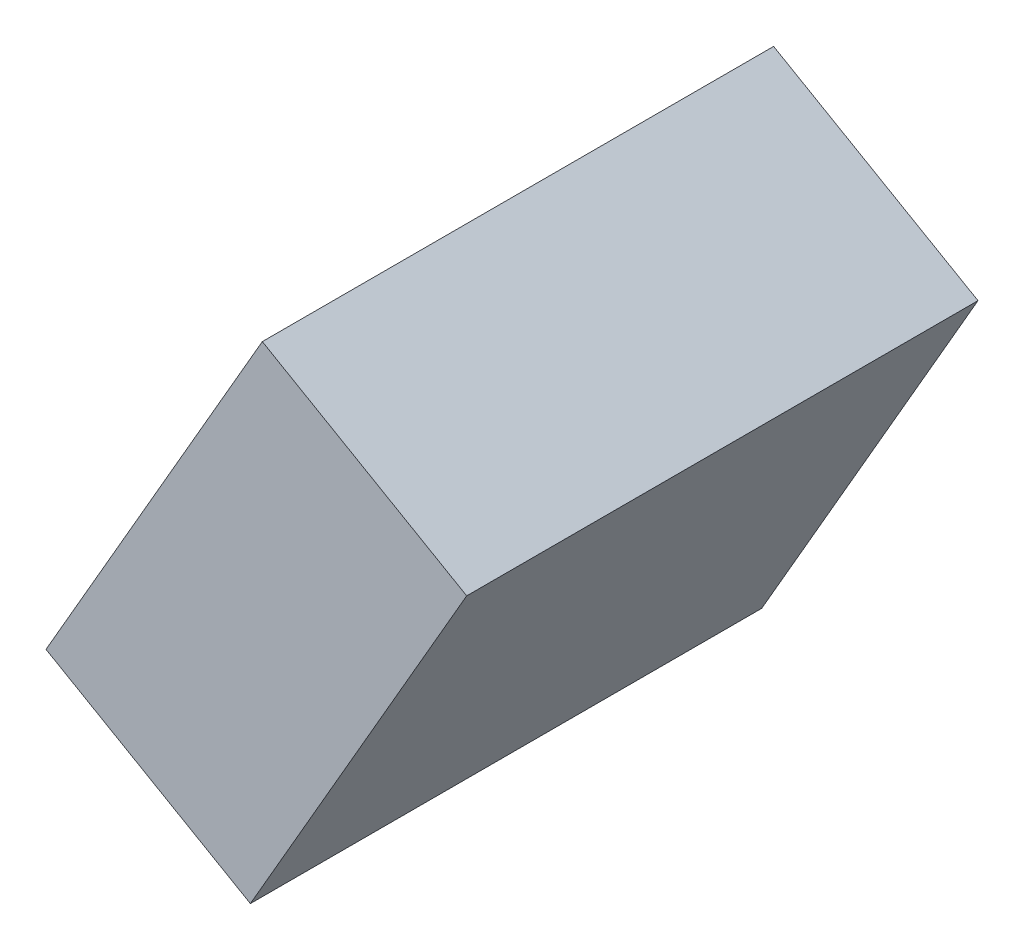
ISO-10303-21;
HEADER;
FILE_DESCRIPTION(('STEP AP214'),'2;1');
FILE_NAME('part.step','',(''),(''),'','','');
FILE_SCHEMA(('AUTOMOTIVE_DESIGN { 1 0 10303 214 1 1 1 1 }'));
ENDSEC;
DATA;
#1=APPLICATION_CONTEXT('core data for automotive mechanical design processes');
#2=APPLICATION_PROTOCOL_DEFINITION('international standard','automotive_design',2000,#1);
#3=PRODUCT_CONTEXT('',#1,'mechanical');
#4=PRODUCT('Part','Part','',(#3));
#5=PRODUCT_RELATED_PRODUCT_CATEGORY('part','',(#4));
#6=PRODUCT_DEFINITION_FORMATION('','',#4);
#7=PRODUCT_DEFINITION_CONTEXT('part definition',#1,'design');
#8=PRODUCT_DEFINITION('design','',#6,#7);
#9=PRODUCT_DEFINITION_SHAPE('','',#8);
#10=(LENGTH_UNIT() NAMED_UNIT(*) SI_UNIT(.MILLI.,.METRE.));
#11=(NAMED_UNIT(*) PLANE_ANGLE_UNIT() SI_UNIT($,.RADIAN.));
#12=(NAMED_UNIT(*) SI_UNIT($,.STERADIAN.) SOLID_ANGLE_UNIT());
#13=UNCERTAINTY_MEASURE_WITH_UNIT(LENGTH_MEASURE(1.E-05),#10,'distance_accuracy_value','');
#14=(GEOMETRIC_REPRESENTATION_CONTEXT(3) GLOBAL_UNCERTAINTY_ASSIGNED_CONTEXT((#13)) GLOBAL_UNIT_ASSIGNED_CONTEXT((#10,
#11,#12)) REPRESENTATION_CONTEXT('',''));
#15=CARTESIAN_POINT('',(0.,0.,0.));
#16=DIRECTION('',(0.,0.,1.));
#17=DIRECTION('',(1.,0.,0.));
#18=AXIS2_PLACEMENT_3D('',#15,#16,#17);
#19=CARTESIAN_POINT('',(-0.01519174000001,-0.62631066,0.));
#20=DIRECTION('',(-0.866024467662735,0.500001621406847,0.));
#21=DIRECTION('',(-0.500001621406847,-0.866024467662735,0.));
#22=AXIS2_PLACEMENT_3D('',#19,#20,#21);
#23=PLANE('',#22);
#24=DIRECTION('',(0.,0.,1.));
#25=VECTOR('',#24,1.);
#26=CARTESIAN_POINT('',(0.53480716,0.32631126,0.));
#27=LINE('',#26,#25);
#28=CARTESIAN_POINT('',(0.534807160000023,0.326311259999987,0.));
#29=VERTEX_POINT('',#28);
#30=CARTESIAN_POINT('',(0.534807160000023,0.326311259999987,1.29999994));
#31=VERTEX_POINT('',#30);
#32=EDGE_CURVE('E20',#29,#31,#27,.T.);
#33=ORIENTED_EDGE('',*,*,#32,.T.);
#34=DIRECTION('',(-0.500001621406764,-0.866024467662783,0.));
#35=VECTOR('',#34,1.);
#36=CARTESIAN_POINT('',(0.53480716,0.32631126,1.29999994));
#37=LINE('',#36,#35);
#38=CARTESIAN_POINT('',(-0.0151917399999705,-0.626310659999932,1.29999994));
#39=VERTEX_POINT('',#38);
#40=EDGE_CURVE('E55',#31,#39,#37,.T.);
#41=ORIENTED_EDGE('',*,*,#40,.T.);
#42=DIRECTION('',(0.,0.,1.));
#43=VECTOR('',#42,1.);
#44=CARTESIAN_POINT('',(-0.0151917399998524,-0.626310659999727,0.));
#45=LINE('',#44,#43);
#46=CARTESIAN_POINT('',(-0.0151917399999705,-0.626310659999932,0.));
#47=VERTEX_POINT('',#46);
#48=EDGE_CURVE('E76',#39,#47,#45,.F.);
#49=ORIENTED_EDGE('',*,*,#48,.T.);
#50=DIRECTION('',(-0.500001621406764,-0.866024467662783,0.));
#51=VECTOR('',#50,1.);
#52=CARTESIAN_POINT('',(0.53480716,0.32631126,0.));
#53=LINE('',#52,#51);
#54=EDGE_CURVE('E58',#29,#47,#53,.T.);
#55=ORIENTED_EDGE('',*,*,#54,.F.);
#56=EDGE_LOOP('',(#33,#41,#49,#55));
#57=FACE_BOUND('',#56,.T.);
#58=ADVANCED_FACE('F17',(#57),#23,.F.);
#59=CARTESIAN_POINT('',(0.53480716,0.32631126,0.));
#60=DIRECTION('',(-0.500002296729118,-0.866024077763204,0.));
#61=DIRECTION('',(0.866024077763204,-0.500002296729118,0.));
#62=AXIS2_PLACEMENT_3D('',#59,#60,#61);
#63=PLANE('',#62);
#64=DIRECTION('',(0.,0.,1.));
#65=VECTOR('',#64,1.);
#66=CARTESIAN_POINT('',(0.01519173999998,0.6263132,0.));
#67=LINE('',#66,#65);
#68=CARTESIAN_POINT('',(0.0151917400000308,0.626313200000088,0.));
#69=VERTEX_POINT('',#68);
#70=CARTESIAN_POINT('',(0.0151917400000308,0.626313200000088,1.29999994));
#71=VERTEX_POINT('',#70);
#72=EDGE_CURVE('E73',#69,#71,#67,.T.);
#73=ORIENTED_EDGE('',*,*,#72,.T.);
#74=DIRECTION('',(0.866024077763373,-0.500002296728824,0.));
#75=VECTOR('',#74,1.);
#76=CARTESIAN_POINT('',(0.01519173999998,0.6263132,1.29999994));
#77=LINE('',#76,#75);
#78=EDGE_CURVE('E63',#71,#31,#77,.T.);
#79=ORIENTED_EDGE('',*,*,#78,.T.);
#80=ORIENTED_EDGE('',*,*,#32,.F.);
#81=DIRECTION('',(0.866024077763373,-0.500002296728824,0.));
#82=VECTOR('',#81,1.);
#83=CARTESIAN_POINT('',(0.01519173999998,0.6263132,0.));
#84=LINE('',#83,#82);
#85=EDGE_CURVE('E78',#69,#29,#84,.T.);
#86=ORIENTED_EDGE('',*,*,#85,.F.);
#87=EDGE_LOOP('',(#73,#79,#80,#86));
#88=FACE_BOUND('',#87,.T.);
#89=ADVANCED_FACE('F72',(#88),#63,.F.);
#90=CARTESIAN_POINT('',(0.01519173999998,0.6263132,1.29999994));
#91=DIRECTION('',(0.,0.,-1.));
#92=DIRECTION('',(-1.,0.,0.));
#93=AXIS2_PLACEMENT_3D('',#90,#91,#92);
#94=PLANE('',#93);
#95=DIRECTION('',(-0.866025910850967,0.499999121733981,0.));
#96=VECTOR('',#95,1.);
#97=CARTESIAN_POINT('',(-0.53480716,-0.32631126,1.29999994));
#98=LINE('',#97,#96);
#99=CARTESIAN_POINT('',(-0.534807159999883,-0.326311260000067,1.29999994));
#100=VERTEX_POINT('',#99);
#101=EDGE_CURVE('E69',#100,#39,#98,.F.);
#102=ORIENTED_EDGE('',*,*,#101,.T.);
#103=ORIENTED_EDGE('',*,*,#40,.F.);
#104=ORIENTED_EDGE('',*,*,#78,.F.);
#105=DIRECTION('',(0.500000621534888,0.866025044940806,0.));
#106=VECTOR('',#105,1.);
#107=CARTESIAN_POINT('',(0.01519173999998,0.6263132,1.29999994));
#108=LINE('',#107,#106);
#109=EDGE_CURVE('E83',#71,#100,#108,.F.);
#110=ORIENTED_EDGE('',*,*,#109,.T.);
#111=EDGE_LOOP('',(#102,#103,#104,#110));
#112=FACE_BOUND('',#111,.T.);
#113=ADVANCED_FACE('F66',(#112),#94,.F.);
#114=CARTESIAN_POINT('',(-0.53480716,-0.32631126,0.));
#115=DIRECTION('',(0.499999121733981,0.866025910850967,0.));
#116=DIRECTION('',(-0.866025910850967,0.499999121733981,0.));
#117=AXIS2_PLACEMENT_3D('',#114,#115,#116);
#118=PLANE('',#117);
#119=ORIENTED_EDGE('',*,*,#48,.F.);
#120=ORIENTED_EDGE('',*,*,#101,.F.);
#121=DIRECTION('',(0.,0.,1.));
#122=VECTOR('',#121,1.);
#123=CARTESIAN_POINT('',(-0.534807159999533,-0.32631126000027,0.));
#124=LINE('',#123,#122);
#125=CARTESIAN_POINT('',(-0.534807159999883,-0.326311260000067,0.));
#126=VERTEX_POINT('',#125);
#127=EDGE_CURVE('E26',#100,#126,#124,.F.);
#128=ORIENTED_EDGE('',*,*,#127,.T.);
#129=DIRECTION('',(-0.866025910850705,0.499999121734436,0.));
#130=VECTOR('',#129,1.);
#131=CARTESIAN_POINT('',(-0.01519174000001,-0.62631066,0.));
#132=LINE('',#131,#130);
#133=EDGE_CURVE('E34',#47,#126,#132,.T.);
#134=ORIENTED_EDGE('',*,*,#133,.F.);
#135=EDGE_LOOP('',(#119,#120,#128,#134));
#136=FACE_BOUND('',#135,.T.);
#137=ADVANCED_FACE('F88',(#136),#118,.F.);
#138=CARTESIAN_POINT('',(0.01519173999998,0.6263132,0.));
#139=DIRECTION('',(0.,0.,-1.));
#140=DIRECTION('',(-1.,0.,0.));
#141=AXIS2_PLACEMENT_3D('',#138,#139,#140);
#142=PLANE('',#141);
#143=ORIENTED_EDGE('',*,*,#133,.T.);
#144=DIRECTION('',(0.500000621534888,0.866025044940806,0.));
#145=VECTOR('',#144,1.);
#146=CARTESIAN_POINT('',(0.01519173999998,0.6263132,0.));
#147=LINE('',#146,#145);
#148=EDGE_CURVE('E11',#126,#69,#147,.T.);
#149=ORIENTED_EDGE('',*,*,#148,.T.);
#150=ORIENTED_EDGE('',*,*,#85,.T.);
#151=ORIENTED_EDGE('',*,*,#54,.T.);
#152=EDGE_LOOP('',(#143,#149,#150,#151));
#153=FACE_BOUND('',#152,.T.);
#154=ADVANCED_FACE('F91',(#153),#142,.T.);
#155=CARTESIAN_POINT('',(0.01519173999998,0.6263132,0.));
#156=DIRECTION('',(0.866025044940806,-0.500000621534888,0.));
#157=DIRECTION('',(0.500000621534888,0.866025044940806,0.));
#158=AXIS2_PLACEMENT_3D('',#155,#156,#157);
#159=PLANE('',#158);
#160=ORIENTED_EDGE('',*,*,#127,.F.);
#161=ORIENTED_EDGE('',*,*,#109,.F.);
#162=ORIENTED_EDGE('',*,*,#72,.F.);
#163=ORIENTED_EDGE('',*,*,#148,.F.);
#164=EDGE_LOOP('',(#160,#161,#162,#163));
#165=FACE_BOUND('',#164,.T.);
#166=ADVANCED_FACE('F90',(#165),#159,.F.);
#167=CLOSED_SHELL('',(#58,#89,#113,#137,#154,#166));
#168=MANIFOLD_SOLID_BREP('B1',#167);
#169=ADVANCED_BREP_SHAPE_REPRESENTATION('',(#18,#168),#14);
#170=SHAPE_DEFINITION_REPRESENTATION(#9,#169);
ENDSEC;
END-ISO-10303-21;
